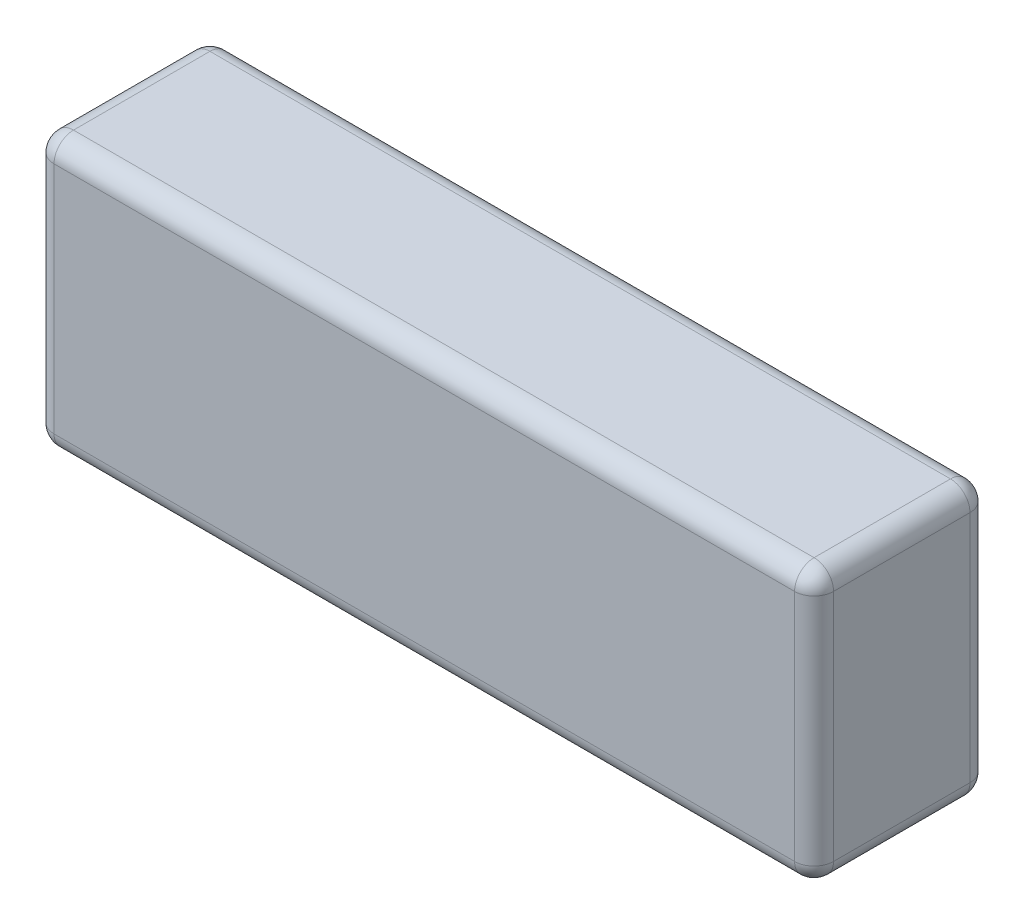
ISO-10303-21;
HEADER;
FILE_DESCRIPTION(('STEP AP214'),'2;1');
FILE_NAME('part.step','',(''),(''),'','','');
FILE_SCHEMA(('AUTOMOTIVE_DESIGN { 1 0 10303 214 1 1 1 1 }'));
ENDSEC;
DATA;
#1=APPLICATION_CONTEXT('core data for automotive mechanical design processes');
#2=APPLICATION_PROTOCOL_DEFINITION('international standard','automotive_design',2000,#1);
#3=PRODUCT_CONTEXT('',#1,'mechanical');
#4=PRODUCT('Part','Part','',(#3));
#5=PRODUCT_RELATED_PRODUCT_CATEGORY('part','',(#4));
#6=PRODUCT_DEFINITION_FORMATION('','',#4);
#7=PRODUCT_DEFINITION_CONTEXT('part definition',#1,'design');
#8=PRODUCT_DEFINITION('design','',#6,#7);
#9=PRODUCT_DEFINITION_SHAPE('','',#8);
#10=(LENGTH_UNIT() NAMED_UNIT(*) SI_UNIT(.MILLI.,.METRE.));
#11=(NAMED_UNIT(*) PLANE_ANGLE_UNIT() SI_UNIT($,.RADIAN.));
#12=(NAMED_UNIT(*) SI_UNIT($,.STERADIAN.) SOLID_ANGLE_UNIT());
#13=UNCERTAINTY_MEASURE_WITH_UNIT(LENGTH_MEASURE(1.E-05),#10,'distance_accuracy_value','');
#14=(GEOMETRIC_REPRESENTATION_CONTEXT(3) GLOBAL_UNCERTAINTY_ASSIGNED_CONTEXT((#13)) GLOBAL_UNIT_ASSIGNED_CONTEXT((#10,
#11,#12)) REPRESENTATION_CONTEXT('',''));
#15=CARTESIAN_POINT('',(0.,0.,0.));
#16=DIRECTION('',(0.,0.,1.));
#17=DIRECTION('',(1.,0.,0.));
#18=AXIS2_PLACEMENT_3D('',#15,#16,#17);
#19=CARTESIAN_POINT('',(-5.,1.75,1.125));
#20=DIRECTION('',(1.,0.,0.));
#21=DIRECTION('',(0.,0.,-1.));
#22=AXIS2_PLACEMENT_3D('',#19,#20,#21);
#23=PLANE('',#22);
#24=DIRECTION('',(0.,-1.,0.));
#25=VECTOR('',#24,1.);
#26=CARTESIAN_POINT('',(-5.,1.75,-0.875));
#27=LINE('',#26,#25);
#28=CARTESIAN_POINT('',(-5.,1.5,-0.875));
#29=VERTEX_POINT('',#28);
#30=CARTESIAN_POINT('',(-5.,-1.5,-0.875));
#31=VERTEX_POINT('',#30);
#32=EDGE_CURVE('E519',#29,#31,#27,.T.);
#33=ORIENTED_EDGE('',*,*,#32,.T.);
#34=DIRECTION('',(0.,0.,-1.));
#35=VECTOR('',#34,1.);
#36=CARTESIAN_POINT('',(-5.,-1.5,1.125));
#37=LINE('',#36,#35);
#38=CARTESIAN_POINT('',(-5.,-1.5,0.875));
#39=VERTEX_POINT('',#38);
#40=EDGE_CURVE('E521',#31,#39,#37,.F.);
#41=ORIENTED_EDGE('',*,*,#40,.T.);
#42=DIRECTION('',(0.,-1.,0.));
#43=VECTOR('',#42,1.);
#44=CARTESIAN_POINT('',(-5.,1.75,0.875));
#45=LINE('',#44,#43);
#46=CARTESIAN_POINT('',(-5.,1.5,0.875));
#47=VERTEX_POINT('',#46);
#48=EDGE_CURVE('E517',#39,#47,#45,.F.);
#49=ORIENTED_EDGE('',*,*,#48,.T.);
#50=DIRECTION('',(0.,0.,-1.));
#51=VECTOR('',#50,1.);
#52=CARTESIAN_POINT('',(-5.,1.5,1.125));
#53=LINE('',#52,#51);
#54=EDGE_CURVE('E515',#47,#29,#53,.T.);
#55=ORIENTED_EDGE('',*,*,#54,.T.);
#56=EDGE_LOOP('',(#33,#41,#49,#55));
#57=FACE_BOUND('',#56,.T.);
#58=ADVANCED_FACE('F373',(#57),#23,.F.);
#59=CARTESIAN_POINT('',(-5.,-1.75,1.125));
#60=DIRECTION('',(0.,1.,0.));
#61=DIRECTION('',(0.,0.,1.));
#62=AXIS2_PLACEMENT_3D('',#59,#60,#61);
#63=PLANE('',#62);
#64=DIRECTION('',(1.,0.,0.));
#65=VECTOR('',#64,1.);
#66=CARTESIAN_POINT('',(-5.,-1.75,-0.875));
#67=LINE('',#66,#65);
#68=CARTESIAN_POINT('',(-4.75,-1.75,-0.875));
#69=VERTEX_POINT('',#68);
#70=CARTESIAN_POINT('',(4.75,-1.75,-0.875));
#71=VERTEX_POINT('',#70);
#72=EDGE_CURVE('E510',#69,#71,#67,.T.);
#73=ORIENTED_EDGE('',*,*,#72,.T.);
#74=DIRECTION('',(0.,0.,-1.));
#75=VECTOR('',#74,1.);
#76=CARTESIAN_POINT('',(4.75,-1.75,1.125));
#77=LINE('',#76,#75);
#78=CARTESIAN_POINT('',(4.75,-1.75,0.875));
#79=VERTEX_POINT('',#78);
#80=EDGE_CURVE('E512',#71,#79,#77,.F.);
#81=ORIENTED_EDGE('',*,*,#80,.T.);
#82=DIRECTION('',(1.,0.,0.));
#83=VECTOR('',#82,1.);
#84=CARTESIAN_POINT('',(-5.,-1.75,0.875));
#85=LINE('',#84,#83);
#86=CARTESIAN_POINT('',(-4.75,-1.75,0.875));
#87=VERTEX_POINT('',#86);
#88=EDGE_CURVE('E506',#79,#87,#85,.F.);
#89=ORIENTED_EDGE('',*,*,#88,.T.);
#90=DIRECTION('',(0.,0.,-1.));
#91=VECTOR('',#90,1.);
#92=CARTESIAN_POINT('',(-4.75,-1.75,1.125));
#93=LINE('',#92,#91);
#94=EDGE_CURVE('E508',#87,#69,#93,.T.);
#95=ORIENTED_EDGE('',*,*,#94,.T.);
#96=EDGE_LOOP('',(#73,#81,#89,#95));
#97=FACE_BOUND('',#96,.T.);
#98=ADVANCED_FACE('F666',(#97),#63,.F.);
#99=CARTESIAN_POINT('',(5.,1.75,1.125));
#100=DIRECTION('',(-1.,0.,0.));
#101=DIRECTION('',(0.,0.,1.));
#102=AXIS2_PLACEMENT_3D('',#99,#100,#101);
#103=PLANE('',#102);
#104=DIRECTION('',(0.,0.,-1.));
#105=VECTOR('',#104,1.);
#106=CARTESIAN_POINT('',(5.,-1.5,1.125));
#107=LINE('',#106,#105);
#108=CARTESIAN_POINT('',(5.,-1.5,0.875));
#109=VERTEX_POINT('',#108);
#110=CARTESIAN_POINT('',(5.,-1.5,-0.875));
#111=VERTEX_POINT('',#110);
#112=EDGE_CURVE('E493',#109,#111,#107,.T.);
#113=ORIENTED_EDGE('',*,*,#112,.T.);
#114=DIRECTION('',(0.,1.,0.));
#115=VECTOR('',#114,1.);
#116=CARTESIAN_POINT('',(5.,1.75,-0.875));
#117=LINE('',#116,#115);
#118=CARTESIAN_POINT('',(5.,1.5,-0.875));
#119=VERTEX_POINT('',#118);
#120=EDGE_CURVE('E464',#111,#119,#117,.T.);
#121=ORIENTED_EDGE('',*,*,#120,.T.);
#122=DIRECTION('',(0.,0.,-1.));
#123=VECTOR('',#122,1.);
#124=CARTESIAN_POINT('',(5.,1.5,1.125));
#125=LINE('',#124,#123);
#126=CARTESIAN_POINT('',(5.,1.5,0.875));
#127=VERTEX_POINT('',#126);
#128=EDGE_CURVE('E482',#119,#127,#125,.F.);
#129=ORIENTED_EDGE('',*,*,#128,.T.);
#130=DIRECTION('',(0.,1.,0.));
#131=VECTOR('',#130,1.);
#132=CARTESIAN_POINT('',(5.,-1.75,0.875));
#133=LINE('',#132,#131);
#134=EDGE_CURVE('E488',#127,#109,#133,.F.);
#135=ORIENTED_EDGE('',*,*,#134,.T.);
#136=EDGE_LOOP('',(#113,#121,#129,#135));
#137=FACE_BOUND('',#136,.T.);
#138=ADVANCED_FACE('F491',(#137),#103,.F.);
#139=CARTESIAN_POINT('',(-5.,1.75,1.125));
#140=DIRECTION('',(0.,-1.,0.));
#141=DIRECTION('',(0.,0.,-1.));
#142=AXIS2_PLACEMENT_3D('',#139,#140,#141);
#143=PLANE('',#142);
#144=DIRECTION('',(-1.,0.,0.));
#145=VECTOR('',#144,1.);
#146=CARTESIAN_POINT('',(5.,1.75,0.875));
#147=LINE('',#146,#145);
#148=CARTESIAN_POINT('',(-4.75,1.75,0.875));
#149=VERTEX_POINT('',#148);
#150=CARTESIAN_POINT('',(4.75,1.75,0.875));
#151=VERTEX_POINT('',#150);
#152=EDGE_CURVE('E380',#149,#151,#147,.F.);
#153=ORIENTED_EDGE('',*,*,#152,.T.);
#154=DIRECTION('',(0.,0.,-1.));
#155=VECTOR('',#154,1.);
#156=CARTESIAN_POINT('',(4.75,1.75,1.125));
#157=LINE('',#156,#155);
#158=CARTESIAN_POINT('',(4.75,1.75,-0.875));
#159=VERTEX_POINT('',#158);
#160=EDGE_CURVE('E11',#151,#159,#157,.T.);
#161=ORIENTED_EDGE('',*,*,#160,.T.);
#162=DIRECTION('',(-1.,0.,0.));
#163=VECTOR('',#162,1.);
#164=CARTESIAN_POINT('',(-5.,1.75,-0.875));
#165=LINE('',#164,#163);
#166=CARTESIAN_POINT('',(-4.75,1.75,-0.875));
#167=VERTEX_POINT('',#166);
#168=EDGE_CURVE('E533',#159,#167,#165,.T.);
#169=ORIENTED_EDGE('',*,*,#168,.T.);
#170=DIRECTION('',(0.,0.,-1.));
#171=VECTOR('',#170,1.);
#172=CARTESIAN_POINT('',(-4.75,1.75,1.125));
#173=LINE('',#172,#171);
#174=EDGE_CURVE('E390',#167,#149,#173,.F.);
#175=ORIENTED_EDGE('',*,*,#174,.T.);
#176=EDGE_LOOP('',(#153,#161,#169,#175));
#177=FACE_BOUND('',#176,.T.);
#178=ADVANCED_FACE('F535',(#177),#143,.F.);
#179=CARTESIAN_POINT('',(-5.,-1.75,1.125));
#180=DIRECTION('',(0.,0.,1.));
#181=DIRECTION('',(1.,0.,0.));
#182=AXIS2_PLACEMENT_3D('',#179,#180,#181);
#183=PLANE('',#182);
#184=DIRECTION('',(1.,0.,0.));
#185=VECTOR('',#184,1.);
#186=CARTESIAN_POINT('',(5.,-1.5,1.125));
#187=LINE('',#186,#185);
#188=CARTESIAN_POINT('',(-4.75,-1.5,1.125));
#189=VERTEX_POINT('',#188);
#190=CARTESIAN_POINT('',(4.75,-1.5,1.125));
#191=VERTEX_POINT('',#190);
#192=EDGE_CURVE('E528',#189,#191,#187,.T.);
#193=ORIENTED_EDGE('',*,*,#192,.T.);
#194=DIRECTION('',(0.,1.,0.));
#195=VECTOR('',#194,1.);
#196=CARTESIAN_POINT('',(4.75,1.75,1.125));
#197=LINE('',#196,#195);
#198=CARTESIAN_POINT('',(4.75,1.5,1.125));
#199=VERTEX_POINT('',#198);
#200=EDGE_CURVE('E530',#191,#199,#197,.T.);
#201=ORIENTED_EDGE('',*,*,#200,.T.);
#202=DIRECTION('',(-1.,0.,0.));
#203=VECTOR('',#202,1.);
#204=CARTESIAN_POINT('',(-5.,1.5,1.125));
#205=LINE('',#204,#203);
#206=CARTESIAN_POINT('',(-4.75,1.5,1.125));
#207=VERTEX_POINT('',#206);
#208=EDGE_CURVE('E524',#199,#207,#205,.T.);
#209=ORIENTED_EDGE('',*,*,#208,.T.);
#210=DIRECTION('',(0.,-1.,0.));
#211=VECTOR('',#210,1.);
#212=CARTESIAN_POINT('',(-4.75,-1.75,1.125));
#213=LINE('',#212,#211);
#214=EDGE_CURVE('E526',#207,#189,#213,.T.);
#215=ORIENTED_EDGE('',*,*,#214,.T.);
#216=EDGE_LOOP('',(#193,#201,#209,#215));
#217=FACE_BOUND('',#216,.T.);
#218=ADVANCED_FACE('F678',(#217),#183,.T.);
#219=CARTESIAN_POINT('',(-5.,-1.75,-1.125));
#220=DIRECTION('',(0.,0.,1.));
#221=DIRECTION('',(1.,0.,0.));
#222=AXIS2_PLACEMENT_3D('',#219,#220,#221);
#223=PLANE('',#222);
#224=DIRECTION('',(-1.,0.,0.));
#225=VECTOR('',#224,1.);
#226=CARTESIAN_POINT('',(-5.,1.5,-1.125));
#227=LINE('',#226,#225);
#228=CARTESIAN_POINT('',(-4.75,1.5,-1.125));
#229=VERTEX_POINT('',#228);
#230=CARTESIAN_POINT('',(4.75,1.5,-1.125));
#231=VERTEX_POINT('',#230);
#232=EDGE_CURVE('E495',#229,#231,#227,.F.);
#233=ORIENTED_EDGE('',*,*,#232,.T.);
#234=DIRECTION('',(0.,1.,0.));
#235=VECTOR('',#234,1.);
#236=CARTESIAN_POINT('',(4.75,-1.75,-1.125));
#237=LINE('',#236,#235);
#238=CARTESIAN_POINT('',(4.75,-1.5,-1.125));
#239=VERTEX_POINT('',#238);
#240=EDGE_CURVE('E466',#231,#239,#237,.F.);
#241=ORIENTED_EDGE('',*,*,#240,.T.);
#242=DIRECTION('',(1.,0.,0.));
#243=VECTOR('',#242,1.);
#244=CARTESIAN_POINT('',(-5.,-1.5,-1.125));
#245=LINE('',#244,#243);
#246=CARTESIAN_POINT('',(-4.75,-1.5,-1.125));
#247=VERTEX_POINT('',#246);
#248=EDGE_CURVE('E503',#239,#247,#245,.F.);
#249=ORIENTED_EDGE('',*,*,#248,.T.);
#250=DIRECTION('',(0.,-1.,0.));
#251=VECTOR('',#250,1.);
#252=CARTESIAN_POINT('',(-4.75,-1.75,-1.125));
#253=LINE('',#252,#251);
#254=EDGE_CURVE('E497',#247,#229,#253,.F.);
#255=ORIENTED_EDGE('',*,*,#254,.T.);
#256=EDGE_LOOP('',(#233,#241,#249,#255));
#257=FACE_BOUND('',#256,.T.);
#258=ADVANCED_FACE('F627',(#257),#223,.F.);
#259=CARTESIAN_POINT('',(-4.75,-1.75,0.875));
#260=DIRECTION('',(0.,1.,0.));
#261=DIRECTION('',(0.,0.,1.));
#262=AXIS2_PLACEMENT_3D('',#259,#260,#261);
#263=CYLINDRICAL_SURFACE('',#262,0.25);
#264=CARTESIAN_POINT('',(-4.75,-1.5,0.875));
#265=DIRECTION('',(0.,-1.,0.));
#266=DIRECTION('',(0.,0.,-1.));
#267=AXIS2_PLACEMENT_3D('',#264,#265,#266);
#268=CIRCLE('',#267,0.25);
#269=EDGE_CURVE('E489',#189,#39,#268,.T.);
#270=ORIENTED_EDGE('',*,*,#269,.F.);
#271=ORIENTED_EDGE('',*,*,#214,.F.);
#272=CARTESIAN_POINT('',(-4.75,1.5,0.875));
#273=DIRECTION('',(0.,1.,0.));
#274=DIRECTION('',(0.,0.,1.));
#275=AXIS2_PLACEMENT_3D('',#272,#273,#274);
#276=CIRCLE('',#275,0.25);
#277=EDGE_CURVE('E596',#47,#207,#276,.T.);
#278=ORIENTED_EDGE('',*,*,#277,.F.);
#279=ORIENTED_EDGE('',*,*,#48,.F.);
#280=EDGE_LOOP('',(#270,#271,#278,#279));
#281=FACE_BOUND('',#280,.T.);
#282=ADVANCED_FACE('F648',(#281),#263,.T.);
#283=CARTESIAN_POINT('',(-4.75,-1.5,0.875));
#284=DIRECTION('',(0.,0.,1.));
#285=DIRECTION('',(1.,0.,0.));
#286=AXIS2_PLACEMENT_3D('',#283,#284,#285);
#287=SPHERICAL_SURFACE('',#286,0.25);
#288=CARTESIAN_POINT('',(-4.75,-1.5,0.875));
#289=DIRECTION('',(-1.,0.,0.));
#290=DIRECTION('',(0.,0.,1.));
#291=AXIS2_PLACEMENT_3D('',#288,#289,#290);
#292=CIRCLE('',#291,0.25);
#293=EDGE_CURVE('E591',#189,#87,#292,.F.);
#294=ORIENTED_EDGE('',*,*,#293,.F.);
#295=ORIENTED_EDGE('',*,*,#269,.T.);
#296=CARTESIAN_POINT('',(-4.75,-1.5,0.875));
#297=DIRECTION('',(0.,0.,1.));
#298=DIRECTION('',(1.,0.,0.));
#299=AXIS2_PLACEMENT_3D('',#296,#297,#298);
#300=CIRCLE('',#299,0.25);
#301=EDGE_CURVE('E594',#87,#39,#300,.F.);
#302=ORIENTED_EDGE('',*,*,#301,.F.);
#303=EDGE_LOOP('',(#294,#295,#302));
#304=FACE_BOUND('',#303,.T.);
#305=ADVANCED_FACE('F643',(#304),#287,.T.);
#306=CARTESIAN_POINT('',(-4.75,1.5,0.875));
#307=DIRECTION('',(0.,0.,1.));
#308=DIRECTION('',(1.,0.,0.));
#309=AXIS2_PLACEMENT_3D('',#306,#307,#308);
#310=SPHERICAL_SURFACE('',#309,0.25);
#311=CARTESIAN_POINT('',(-4.75,1.5,0.875));
#312=DIRECTION('',(0.,0.,1.));
#313=DIRECTION('',(1.,0.,0.));
#314=AXIS2_PLACEMENT_3D('',#311,#312,#313);
#315=CIRCLE('',#314,0.25);
#316=EDGE_CURVE('E546',#47,#149,#315,.F.);
#317=ORIENTED_EDGE('',*,*,#316,.F.);
#318=ORIENTED_EDGE('',*,*,#277,.T.);
#319=CARTESIAN_POINT('',(-4.75,1.5,0.875));
#320=DIRECTION('',(-1.,0.,0.));
#321=DIRECTION('',(0.,0.,1.));
#322=AXIS2_PLACEMENT_3D('',#319,#320,#321);
#323=CIRCLE('',#322,0.25);
#324=EDGE_CURVE('E588',#149,#207,#323,.F.);
#325=ORIENTED_EDGE('',*,*,#324,.F.);
#326=EDGE_LOOP('',(#317,#318,#325));
#327=FACE_BOUND('',#326,.T.);
#328=ADVANCED_FACE('F650',(#327),#310,.T.);
#329=CARTESIAN_POINT('',(-4.75,-1.5,1.125));
#330=DIRECTION('',(0.,0.,-1.));
#331=DIRECTION('',(-1.,0.,0.));
#332=AXIS2_PLACEMENT_3D('',#329,#330,#331);
#333=CYLINDRICAL_SURFACE('',#332,0.25);
#334=ORIENTED_EDGE('',*,*,#301,.T.);
#335=ORIENTED_EDGE('',*,*,#40,.F.);
#336=CARTESIAN_POINT('',(-4.75,-1.5,-0.875));
#337=DIRECTION('',(0.,0.,-1.));
#338=DIRECTION('',(-1.,0.,0.));
#339=AXIS2_PLACEMENT_3D('',#336,#337,#338);
#340=CIRCLE('',#339,0.25);
#341=EDGE_CURVE('E581',#69,#31,#340,.T.);
#342=ORIENTED_EDGE('',*,*,#341,.F.);
#343=ORIENTED_EDGE('',*,*,#94,.F.);
#344=EDGE_LOOP('',(#334,#335,#342,#343));
#345=FACE_BOUND('',#344,.T.);
#346=ADVANCED_FACE('F636',(#345),#333,.T.);
#347=CARTESIAN_POINT('',(-5.,-1.5,0.875));
#348=DIRECTION('',(-1.,0.,0.));
#349=DIRECTION('',(0.,0.,1.));
#350=AXIS2_PLACEMENT_3D('',#347,#348,#349);
#351=CYLINDRICAL_SURFACE('',#350,0.25);
#352=ORIENTED_EDGE('',*,*,#293,.T.);
#353=ORIENTED_EDGE('',*,*,#88,.F.);
#354=CARTESIAN_POINT('',(4.75,-1.5,0.875));
#355=DIRECTION('',(1.,0.,0.));
#356=DIRECTION('',(0.,0.,-1.));
#357=AXIS2_PLACEMENT_3D('',#354,#355,#356);
#358=CIRCLE('',#357,0.25);
#359=EDGE_CURVE('E578',#191,#79,#358,.T.);
#360=ORIENTED_EDGE('',*,*,#359,.F.);
#361=ORIENTED_EDGE('',*,*,#192,.F.);
#362=EDGE_LOOP('',(#352,#353,#360,#361));
#363=FACE_BOUND('',#362,.T.);
#364=ADVANCED_FACE('F692',(#363),#351,.T.);
#365=CARTESIAN_POINT('',(4.75,-1.75,0.875));
#366=DIRECTION('',(0.,-1.,0.));
#367=DIRECTION('',(0.,0.,-1.));
#368=AXIS2_PLACEMENT_3D('',#365,#366,#367);
#369=CYLINDRICAL_SURFACE('',#368,0.25);
#370=CARTESIAN_POINT('',(4.75,1.5,0.875));
#371=DIRECTION('',(0.,1.,0.));
#372=DIRECTION('',(-1.,0.,0.));
#373=AXIS2_PLACEMENT_3D('',#370,#371,#372);
#374=CIRCLE('',#373,0.25);
#375=EDGE_CURVE('E572',#199,#127,#374,.T.);
#376=ORIENTED_EDGE('',*,*,#375,.F.);
#377=ORIENTED_EDGE('',*,*,#200,.F.);
#378=CARTESIAN_POINT('',(4.75,-1.5,0.875));
#379=DIRECTION('',(0.,-1.,0.));
#380=DIRECTION('',(0.,0.,-1.));
#381=AXIS2_PLACEMENT_3D('',#378,#379,#380);
#382=CIRCLE('',#381,0.25);
#383=EDGE_CURVE('E575',#109,#191,#382,.T.);
#384=ORIENTED_EDGE('',*,*,#383,.F.);
#385=ORIENTED_EDGE('',*,*,#134,.F.);
#386=EDGE_LOOP('',(#376,#377,#384,#385));
#387=FACE_BOUND('',#386,.T.);
#388=ADVANCED_FACE('F605',(#387),#369,.T.);
#389=CARTESIAN_POINT('',(-5.,1.5,0.875));
#390=DIRECTION('',(1.,0.,0.));
#391=DIRECTION('',(0.,0.,-1.));
#392=AXIS2_PLACEMENT_3D('',#389,#390,#391);
#393=CYLINDRICAL_SURFACE('',#392,0.25);
#394=ORIENTED_EDGE('',*,*,#324,.T.);
#395=ORIENTED_EDGE('',*,*,#208,.F.);
#396=CARTESIAN_POINT('',(4.75,1.5,0.875));
#397=DIRECTION('',(1.,0.,0.));
#398=DIRECTION('',(0.,0.,-1.));
#399=AXIS2_PLACEMENT_3D('',#396,#397,#398);
#400=CIRCLE('',#399,0.25);
#401=EDGE_CURVE('E555',#151,#199,#400,.T.);
#402=ORIENTED_EDGE('',*,*,#401,.F.);
#403=ORIENTED_EDGE('',*,*,#152,.F.);
#404=EDGE_LOOP('',(#394,#395,#402,#403));
#405=FACE_BOUND('',#404,.T.);
#406=ADVANCED_FACE('F653',(#405),#393,.T.);
#407=CARTESIAN_POINT('',(-4.75,1.5,1.125));
#408=DIRECTION('',(0.,0.,-1.));
#409=DIRECTION('',(-1.,0.,0.));
#410=AXIS2_PLACEMENT_3D('',#407,#408,#409);
#411=CYLINDRICAL_SURFACE('',#410,0.25);
#412=ORIENTED_EDGE('',*,*,#316,.T.);
#413=ORIENTED_EDGE('',*,*,#174,.F.);
#414=CARTESIAN_POINT('',(-4.75,1.5,-0.875));
#415=DIRECTION('',(0.,0.,-1.));
#416=DIRECTION('',(-1.,0.,0.));
#417=AXIS2_PLACEMENT_3D('',#414,#415,#416);
#418=CIRCLE('',#417,0.25);
#419=EDGE_CURVE('E543',#29,#167,#418,.T.);
#420=ORIENTED_EDGE('',*,*,#419,.F.);
#421=ORIENTED_EDGE('',*,*,#54,.F.);
#422=EDGE_LOOP('',(#412,#413,#420,#421));
#423=FACE_BOUND('',#422,.T.);
#424=ADVANCED_FACE('F541',(#423),#411,.T.);
#425=CARTESIAN_POINT('',(-4.75,1.75,-0.875));
#426=DIRECTION('',(0.,-1.,0.));
#427=DIRECTION('',(0.,0.,-1.));
#428=AXIS2_PLACEMENT_3D('',#425,#426,#427);
#429=CYLINDRICAL_SURFACE('',#428,0.25);
#430=CARTESIAN_POINT('',(-4.75,-1.5,-0.875));
#431=DIRECTION('',(0.,-1.,0.));
#432=DIRECTION('',(0.,0.,-1.));
#433=AXIS2_PLACEMENT_3D('',#430,#431,#432);
#434=CIRCLE('',#433,0.25);
#435=EDGE_CURVE('E584',#31,#247,#434,.T.);
#436=ORIENTED_EDGE('',*,*,#435,.F.);
#437=ORIENTED_EDGE('',*,*,#32,.F.);
#438=CARTESIAN_POINT('',(-4.75,1.5,-0.875));
#439=DIRECTION('',(0.,1.,0.));
#440=DIRECTION('',(0.,0.,1.));
#441=AXIS2_PLACEMENT_3D('',#438,#439,#440);
#442=CIRCLE('',#441,0.25);
#443=EDGE_CURVE('E554',#229,#29,#442,.T.);
#444=ORIENTED_EDGE('',*,*,#443,.F.);
#445=ORIENTED_EDGE('',*,*,#254,.F.);
#446=EDGE_LOOP('',(#436,#437,#444,#445));
#447=FACE_BOUND('',#446,.T.);
#448=ADVANCED_FACE('F631',(#447),#429,.T.);
#449=CARTESIAN_POINT('',(-4.75,-1.5,-0.875));
#450=DIRECTION('',(0.,0.,1.));
#451=DIRECTION('',(1.,0.,0.));
#452=AXIS2_PLACEMENT_3D('',#449,#450,#451);
#453=SPHERICAL_SURFACE('',#452,0.25);
#454=ORIENTED_EDGE('',*,*,#341,.T.);
#455=ORIENTED_EDGE('',*,*,#435,.T.);
#456=CARTESIAN_POINT('',(-4.75,-1.5,-0.875));
#457=DIRECTION('',(-1.,0.,0.));
#458=DIRECTION('',(0.,0.,1.));
#459=AXIS2_PLACEMENT_3D('',#456,#457,#458);
#460=CIRCLE('',#459,0.25);
#461=EDGE_CURVE('E567',#69,#247,#460,.F.);
#462=ORIENTED_EDGE('',*,*,#461,.F.);
#463=EDGE_LOOP('',(#454,#455,#462));
#464=FACE_BOUND('',#463,.T.);
#465=ADVANCED_FACE('F663',(#464),#453,.T.);
#466=CARTESIAN_POINT('',(4.75,-1.5,0.875));
#467=DIRECTION('',(0.,0.,1.));
#468=DIRECTION('',(1.,0.,0.));
#469=AXIS2_PLACEMENT_3D('',#466,#467,#468);
#470=SPHERICAL_SURFACE('',#469,0.25);
#471=ORIENTED_EDGE('',*,*,#383,.T.);
#472=ORIENTED_EDGE('',*,*,#359,.T.);
#473=CARTESIAN_POINT('',(4.75,-1.5,0.875));
#474=DIRECTION('',(0.,0.,1.));
#475=DIRECTION('',(1.,0.,0.));
#476=AXIS2_PLACEMENT_3D('',#473,#474,#475);
#477=CIRCLE('',#476,0.25);
#478=EDGE_CURVE('E560',#109,#79,#477,.F.);
#479=ORIENTED_EDGE('',*,*,#478,.F.);
#480=EDGE_LOOP('',(#471,#472,#479));
#481=FACE_BOUND('',#480,.T.);
#482=ADVANCED_FACE('F608',(#481),#470,.T.);
#483=CARTESIAN_POINT('',(4.75,1.5,0.875));
#484=DIRECTION('',(0.,0.,1.));
#485=DIRECTION('',(1.,0.,0.));
#486=AXIS2_PLACEMENT_3D('',#483,#484,#485);
#487=SPHERICAL_SURFACE('',#486,0.25);
#488=ORIENTED_EDGE('',*,*,#401,.T.);
#489=ORIENTED_EDGE('',*,*,#375,.T.);
#490=CARTESIAN_POINT('',(4.75,1.5,0.875));
#491=DIRECTION('',(0.,0.,1.));
#492=DIRECTION('',(1.,0.,0.));
#493=AXIS2_PLACEMENT_3D('',#490,#491,#492);
#494=CIRCLE('',#493,0.25);
#495=EDGE_CURVE('E485',#151,#127,#494,.F.);
#496=ORIENTED_EDGE('',*,*,#495,.F.);
#497=EDGE_LOOP('',(#488,#489,#496));
#498=FACE_BOUND('',#497,.T.);
#499=ADVANCED_FACE('F655',(#498),#487,.T.);
#500=CARTESIAN_POINT('',(-4.75,1.5,-0.875));
#501=DIRECTION('',(0.,0.,1.));
#502=DIRECTION('',(1.,0.,0.));
#503=AXIS2_PLACEMENT_3D('',#500,#501,#502);
#504=SPHERICAL_SURFACE('',#503,0.25);
#505=ORIENTED_EDGE('',*,*,#443,.T.);
#506=ORIENTED_EDGE('',*,*,#419,.T.);
#507=CARTESIAN_POINT('',(-4.75,1.5,-0.875));
#508=DIRECTION('',(-1.,0.,0.));
#509=DIRECTION('',(0.,0.,1.));
#510=AXIS2_PLACEMENT_3D('',#507,#508,#509);
#511=CIRCLE('',#510,0.25);
#512=EDGE_CURVE('E551',#229,#167,#511,.F.);
#513=ORIENTED_EDGE('',*,*,#512,.F.);
#514=EDGE_LOOP('',(#505,#506,#513));
#515=FACE_BOUND('',#514,.T.);
#516=ADVANCED_FACE('F550',(#515),#504,.T.);
#517=CARTESIAN_POINT('',(-5.,-1.5,-0.875));
#518=DIRECTION('',(1.,0.,0.));
#519=DIRECTION('',(0.,0.,-1.));
#520=AXIS2_PLACEMENT_3D('',#517,#518,#519);
#521=CYLINDRICAL_SURFACE('',#520,0.25);
#522=ORIENTED_EDGE('',*,*,#461,.T.);
#523=ORIENTED_EDGE('',*,*,#248,.F.);
#524=CARTESIAN_POINT('',(4.75,-1.5,-0.875));
#525=DIRECTION('',(1.,0.,0.));
#526=DIRECTION('',(0.,0.,-1.));
#527=AXIS2_PLACEMENT_3D('',#524,#525,#526);
#528=CIRCLE('',#527,0.25);
#529=EDGE_CURVE('E558',#71,#239,#528,.T.);
#530=ORIENTED_EDGE('',*,*,#529,.F.);
#531=ORIENTED_EDGE('',*,*,#72,.F.);
#532=EDGE_LOOP('',(#522,#523,#530,#531));
#533=FACE_BOUND('',#532,.T.);
#534=ADVANCED_FACE('F623',(#533),#521,.T.);
#535=CARTESIAN_POINT('',(4.75,-1.5,1.125));
#536=DIRECTION('',(0.,0.,-1.));
#537=DIRECTION('',(-1.,0.,0.));
#538=AXIS2_PLACEMENT_3D('',#535,#536,#537);
#539=CYLINDRICAL_SURFACE('',#538,0.25);
#540=ORIENTED_EDGE('',*,*,#478,.T.);
#541=ORIENTED_EDGE('',*,*,#80,.F.);
#542=CARTESIAN_POINT('',(4.75,-1.5,-0.875));
#543=DIRECTION('',(0.,0.,-1.));
#544=DIRECTION('',(-1.,0.,0.));
#545=AXIS2_PLACEMENT_3D('',#542,#543,#544);
#546=CIRCLE('',#545,0.25);
#547=EDGE_CURVE('E479',#111,#71,#546,.T.);
#548=ORIENTED_EDGE('',*,*,#547,.F.);
#549=ORIENTED_EDGE('',*,*,#112,.F.);
#550=EDGE_LOOP('',(#540,#541,#548,#549));
#551=FACE_BOUND('',#550,.T.);
#552=ADVANCED_FACE('F612',(#551),#539,.T.);
#553=CARTESIAN_POINT('',(4.75,1.5,1.125));
#554=DIRECTION('',(0.,0.,-1.));
#555=DIRECTION('',(-1.,0.,0.));
#556=AXIS2_PLACEMENT_3D('',#553,#554,#555);
#557=CYLINDRICAL_SURFACE('',#556,0.25);
#558=ORIENTED_EDGE('',*,*,#495,.T.);
#559=ORIENTED_EDGE('',*,*,#128,.F.);
#560=CARTESIAN_POINT('',(4.75,1.5,-0.875));
#561=DIRECTION('',(0.,0.,-1.));
#562=DIRECTION('',(-1.,0.,0.));
#563=AXIS2_PLACEMENT_3D('',#560,#561,#562);
#564=CIRCLE('',#563,0.25);
#565=EDGE_CURVE('E471',#159,#119,#564,.T.);
#566=ORIENTED_EDGE('',*,*,#565,.F.);
#567=ORIENTED_EDGE('',*,*,#160,.F.);
#568=EDGE_LOOP('',(#558,#559,#566,#567));
#569=FACE_BOUND('',#568,.T.);
#570=ADVANCED_FACE('F483',(#569),#557,.T.);
#571=CARTESIAN_POINT('',(-5.,1.5,-0.875));
#572=DIRECTION('',(-1.,0.,0.));
#573=DIRECTION('',(0.,0.,1.));
#574=AXIS2_PLACEMENT_3D('',#571,#572,#573);
#575=CYLINDRICAL_SURFACE('',#574,0.25);
#576=ORIENTED_EDGE('',*,*,#512,.T.);
#577=ORIENTED_EDGE('',*,*,#168,.F.);
#578=CARTESIAN_POINT('',(4.75,1.5,-0.875));
#579=DIRECTION('',(1.,0.,0.));
#580=DIRECTION('',(0.,0.,-1.));
#581=AXIS2_PLACEMENT_3D('',#578,#579,#580);
#582=CIRCLE('',#581,0.25);
#583=EDGE_CURVE('E475',#231,#159,#582,.T.);
#584=ORIENTED_EDGE('',*,*,#583,.F.);
#585=ORIENTED_EDGE('',*,*,#232,.F.);
#586=EDGE_LOOP('',(#576,#577,#584,#585));
#587=FACE_BOUND('',#586,.T.);
#588=ADVANCED_FACE('F557',(#587),#575,.T.);
#589=CARTESIAN_POINT('',(4.75,-1.5,-0.875));
#590=DIRECTION('',(0.,0.,1.));
#591=DIRECTION('',(1.,0.,0.));
#592=AXIS2_PLACEMENT_3D('',#589,#590,#591);
#593=SPHERICAL_SURFACE('',#592,0.25);
#594=ORIENTED_EDGE('',*,*,#547,.T.);
#595=ORIENTED_EDGE('',*,*,#529,.T.);
#596=CARTESIAN_POINT('',(4.75,-1.5,-0.875));
#597=DIRECTION('',(0.,-1.,0.));
#598=DIRECTION('',(1.,0.,0.));
#599=AXIS2_PLACEMENT_3D('',#596,#597,#598);
#600=CIRCLE('',#599,0.25);
#601=EDGE_CURVE('E468',#111,#239,#600,.F.);
#602=ORIENTED_EDGE('',*,*,#601,.F.);
#603=EDGE_LOOP('',(#594,#595,#602));
#604=FACE_BOUND('',#603,.T.);
#605=ADVANCED_FACE('F617',(#604),#593,.T.);
#606=CARTESIAN_POINT('',(4.75,1.5,-0.875));
#607=DIRECTION('',(0.,0.,1.));
#608=DIRECTION('',(1.,0.,0.));
#609=AXIS2_PLACEMENT_3D('',#606,#607,#608);
#610=SPHERICAL_SURFACE('',#609,0.25);
#611=ORIENTED_EDGE('',*,*,#583,.T.);
#612=ORIENTED_EDGE('',*,*,#565,.T.);
#613=CARTESIAN_POINT('',(4.75,1.5,-0.875));
#614=DIRECTION('',(0.,1.,0.));
#615=DIRECTION('',(0.,0.,1.));
#616=AXIS2_PLACEMENT_3D('',#613,#614,#615);
#617=CIRCLE('',#616,0.25);
#618=EDGE_CURVE('E460',#231,#119,#617,.F.);
#619=ORIENTED_EDGE('',*,*,#618,.F.);
#620=EDGE_LOOP('',(#611,#612,#619));
#621=FACE_BOUND('',#620,.T.);
#622=ADVANCED_FACE('F473',(#621),#610,.T.);
#623=CARTESIAN_POINT('',(4.75,1.75,-0.875));
#624=DIRECTION('',(0.,1.,0.));
#625=DIRECTION('',(0.,0.,1.));
#626=AXIS2_PLACEMENT_3D('',#623,#624,#625);
#627=CYLINDRICAL_SURFACE('',#626,0.25);
#628=ORIENTED_EDGE('',*,*,#601,.T.);
#629=ORIENTED_EDGE('',*,*,#240,.F.);
#630=ORIENTED_EDGE('',*,*,#618,.T.);
#631=ORIENTED_EDGE('',*,*,#120,.F.);
#632=EDGE_LOOP('',(#628,#629,#630,#631));
#633=FACE_BOUND('',#632,.T.);
#634=ADVANCED_FACE('F462',(#633),#627,.T.);
#635=CLOSED_SHELL('',(#58,#98,#138,#178,#218,#258,#282,#305,#328,#346,#364,#388,#406,#424,#448,
#465,#482,#499,#516,#534,#552,#570,#588,#605,#622,#634));
#636=MANIFOLD_SOLID_BREP('B2',#635);
#637=ADVANCED_BREP_SHAPE_REPRESENTATION('',(#18,#636),#14);
#638=SHAPE_DEFINITION_REPRESENTATION(#9,#637);
ENDSEC;
END-ISO-10303-21;
